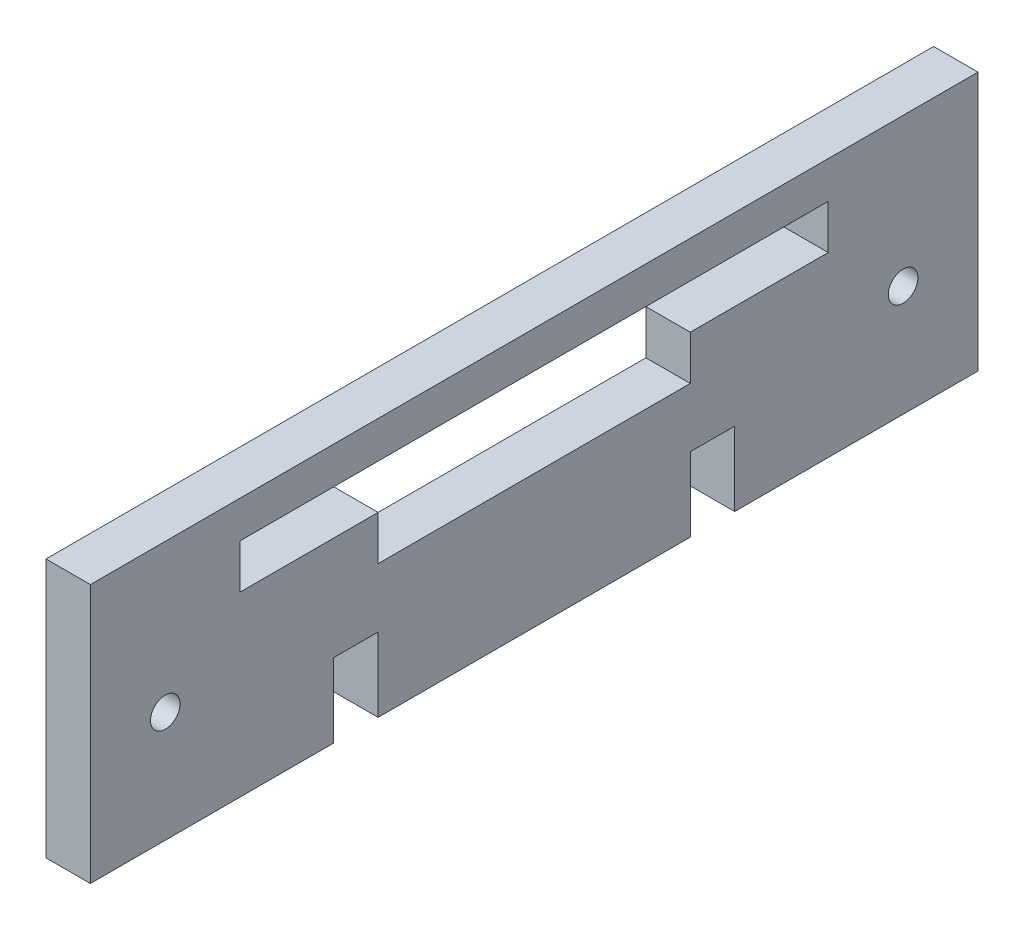
ISO-10303-21;
HEADER;
FILE_DESCRIPTION(('STEP AP214'),'2;1');
FILE_NAME('part.step','',(''),(''),'','','');
FILE_SCHEMA(('AUTOMOTIVE_DESIGN { 1 0 10303 214 1 1 1 1 }'));
ENDSEC;
DATA;
#1=APPLICATION_CONTEXT('core data for automotive mechanical design processes');
#2=APPLICATION_PROTOCOL_DEFINITION('international standard','automotive_design',2000,#1);
#3=PRODUCT_CONTEXT('',#1,'mechanical');
#4=PRODUCT('Part','Part','',(#3));
#5=PRODUCT_RELATED_PRODUCT_CATEGORY('part','',(#4));
#6=PRODUCT_DEFINITION_FORMATION('','',#4);
#7=PRODUCT_DEFINITION_CONTEXT('part definition',#1,'design');
#8=PRODUCT_DEFINITION('design','',#6,#7);
#9=PRODUCT_DEFINITION_SHAPE('','',#8);
#10=(LENGTH_UNIT() NAMED_UNIT(*) SI_UNIT(.MILLI.,.METRE.));
#11=(NAMED_UNIT(*) PLANE_ANGLE_UNIT() SI_UNIT($,.RADIAN.));
#12=(NAMED_UNIT(*) SI_UNIT($,.STERADIAN.) SOLID_ANGLE_UNIT());
#13=UNCERTAINTY_MEASURE_WITH_UNIT(LENGTH_MEASURE(1.E-05),#10,'distance_accuracy_value','');
#14=(GEOMETRIC_REPRESENTATION_CONTEXT(3) GLOBAL_UNCERTAINTY_ASSIGNED_CONTEXT((#13)) GLOBAL_UNIT_ASSIGNED_CONTEXT((#10,
#11,#12)) REPRESENTATION_CONTEXT('',''));
#15=CARTESIAN_POINT('',(0.,0.,0.));
#16=DIRECTION('',(0.,0.,1.));
#17=DIRECTION('',(1.,0.,0.));
#18=AXIS2_PLACEMENT_3D('',#15,#16,#17);
#19=CARTESIAN_POINT('',(6.,9.,39.75));
#20=DIRECTION('',(0.,-1.,0.));
#21=DIRECTION('',(0.,0.,-1.));
#22=AXIS2_PLACEMENT_3D('',#19,#20,#21);
#23=PLANE('',#22);
#24=DIRECTION('',(1.,0.,0.));
#25=VECTOR('',#24,1.);
#26=CARTESIAN_POINT('',(0.,9.,-21.1));
#27=LINE('',#26,#25);
#28=CARTESIAN_POINT('',(0.,9.,-21.1));
#29=VERTEX_POINT('',#28);
#30=CARTESIAN_POINT('',(6.,9.,-21.1));
#31=VERTEX_POINT('',#30);
#32=EDGE_CURVE('E55',#29,#31,#27,.T.);
#33=ORIENTED_EDGE('',*,*,#32,.T.);
#34=DIRECTION('',(0.,0.,1.));
#35=VECTOR('',#34,1.);
#36=CARTESIAN_POINT('',(6.,9.,39.75));
#37=LINE('',#36,#35);
#38=CARTESIAN_POINT('',(6.,9.,-39.75));
#39=VERTEX_POINT('',#38);
#40=EDGE_CURVE('E273',#39,#31,#37,.T.);
#41=ORIENTED_EDGE('',*,*,#40,.F.);
#42=DIRECTION('',(-1.,0.,0.));
#43=VECTOR('',#42,1.);
#44=CARTESIAN_POINT('',(6.,9.,-39.75));
#45=LINE('',#44,#43);
#46=CARTESIAN_POINT('',(0.,9.,-39.75));
#47=VERTEX_POINT('',#46);
#48=EDGE_CURVE('E47',#39,#47,#45,.T.);
#49=ORIENTED_EDGE('',*,*,#48,.T.);
#50=DIRECTION('',(0.,0.,1.));
#51=VECTOR('',#50,1.);
#52=CARTESIAN_POINT('',(0.,9.,39.75));
#53=LINE('',#52,#51);
#54=EDGE_CURVE('E382',#47,#29,#53,.T.);
#55=ORIENTED_EDGE('',*,*,#54,.T.);
#56=EDGE_LOOP('',(#33,#41,#49,#55));
#57=FACE_BOUND('',#56,.T.);
#58=ADVANCED_FACE('F38',(#57),#23,.F.);
#59=CARTESIAN_POINT('',(6.,-15.,60.));
#60=DIRECTION('',(0.,1.,0.));
#61=DIRECTION('',(0.,0.,1.));
#62=AXIS2_PLACEMENT_3D('',#59,#60,#61);
#63=PLANE('',#62);
#64=DIRECTION('',(0.,0.,-1.));
#65=VECTOR('',#64,1.);
#66=CARTESIAN_POINT('',(0.,-15.,60.));
#67=LINE('',#66,#65);
#68=CARTESIAN_POINT('',(0.,-15.,60.));
#69=VERTEX_POINT('',#68);
#70=CARTESIAN_POINT('',(0.,-15.,27.1));
#71=VERTEX_POINT('',#70);
#72=EDGE_CURVE('E265',#69,#71,#67,.T.);
#73=ORIENTED_EDGE('',*,*,#72,.T.);
#74=DIRECTION('',(1.,0.,0.));
#75=VECTOR('',#74,1.);
#76=CARTESIAN_POINT('',(0.,-15.,27.1));
#77=LINE('',#76,#75);
#78=CARTESIAN_POINT('',(6.,-15.,27.1));
#79=VERTEX_POINT('',#78);
#80=EDGE_CURVE('E345',#71,#79,#77,.T.);
#81=ORIENTED_EDGE('',*,*,#80,.T.);
#82=DIRECTION('',(0.,0.,-1.));
#83=VECTOR('',#82,1.);
#84=CARTESIAN_POINT('',(6.,-15.,60.));
#85=LINE('',#84,#83);
#86=CARTESIAN_POINT('',(6.,-15.,60.));
#87=VERTEX_POINT('',#86);
#88=EDGE_CURVE('E235',#87,#79,#85,.T.);
#89=ORIENTED_EDGE('',*,*,#88,.F.);
#90=DIRECTION('',(-1.,0.,0.));
#91=VECTOR('',#90,1.);
#92=CARTESIAN_POINT('',(6.,-15.,60.));
#93=LINE('',#92,#91);
#94=EDGE_CURVE('E370',#87,#69,#93,.T.);
#95=ORIENTED_EDGE('',*,*,#94,.T.);
#96=EDGE_LOOP('',(#73,#81,#89,#95));
#97=FACE_BOUND('',#96,.T.);
#98=ADVANCED_FACE('F420',(#97),#63,.F.);
#99=CARTESIAN_POINT('',(6.,-15.,21.1));
#100=VERTEX_POINT('',#99);
#101=CARTESIAN_POINT('',(6.,-15.,-21.1));
#102=VERTEX_POINT('',#101);
#103=EDGE_CURVE('E242',#100,#102,#85,.T.);
#104=ORIENTED_EDGE('',*,*,#103,.F.);
#105=DIRECTION('',(1.,0.,0.));
#106=VECTOR('',#105,1.);
#107=CARTESIAN_POINT('',(0.,-15.,21.1));
#108=LINE('',#107,#106);
#109=CARTESIAN_POINT('',(0.,-15.,21.1));
#110=VERTEX_POINT('',#109);
#111=EDGE_CURVE('E348',#110,#100,#108,.T.);
#112=ORIENTED_EDGE('',*,*,#111,.F.);
#113=CARTESIAN_POINT('',(0.,-15.,-21.1));
#114=VERTEX_POINT('',#113);
#115=EDGE_CURVE('E393',#110,#114,#67,.T.);
#116=ORIENTED_EDGE('',*,*,#115,.T.);
#117=DIRECTION('',(1.,0.,0.));
#118=VECTOR('',#117,1.);
#119=CARTESIAN_POINT('',(0.,-15.,-21.1));
#120=LINE('',#119,#118);
#121=EDGE_CURVE('E315',#114,#102,#120,.T.);
#122=ORIENTED_EDGE('',*,*,#121,.T.);
#123=EDGE_LOOP('',(#104,#112,#116,#122));
#124=FACE_BOUND('',#123,.T.);
#125=ADVANCED_FACE('F426',(#124),#63,.F.);
#126=CARTESIAN_POINT('',(6.,15.,-60.));
#127=DIRECTION('',(0.,0.,1.));
#128=DIRECTION('',(1.,0.,0.));
#129=AXIS2_PLACEMENT_3D('',#126,#127,#128);
#130=PLANE('',#129);
#131=DIRECTION('',(0.,1.,0.));
#132=VECTOR('',#131,1.);
#133=CARTESIAN_POINT('',(0.,15.,-60.));
#134=LINE('',#133,#132);
#135=CARTESIAN_POINT('',(0.,-15.,-60.));
#136=VERTEX_POINT('',#135);
#137=CARTESIAN_POINT('',(0.,20.,-60.));
#138=VERTEX_POINT('',#137);
#139=EDGE_CURVE('E247',#136,#138,#134,.T.);
#140=ORIENTED_EDGE('',*,*,#139,.T.);
#141=DIRECTION('',(-1.,0.,0.));
#142=VECTOR('',#141,1.);
#143=CARTESIAN_POINT('',(0.,20.,-60.));
#144=LINE('',#143,#142);
#145=CARTESIAN_POINT('',(6.,20.,-60.));
#146=VERTEX_POINT('',#145);
#147=EDGE_CURVE('E298',#146,#138,#144,.T.);
#148=ORIENTED_EDGE('',*,*,#147,.F.);
#149=DIRECTION('',(0.,1.,0.));
#150=VECTOR('',#149,1.);
#151=CARTESIAN_POINT('',(6.,15.,-60.));
#152=LINE('',#151,#150);
#153=CARTESIAN_POINT('',(6.,-15.,-60.));
#154=VERTEX_POINT('',#153);
#155=EDGE_CURVE('E260',#154,#146,#152,.T.);
#156=ORIENTED_EDGE('',*,*,#155,.F.);
#157=DIRECTION('',(-1.,0.,0.));
#158=VECTOR('',#157,1.);
#159=CARTESIAN_POINT('',(6.,-15.,-60.));
#160=LINE('',#159,#158);
#161=EDGE_CURVE('E241',#154,#136,#160,.T.);
#162=ORIENTED_EDGE('',*,*,#161,.T.);
#163=EDGE_LOOP('',(#140,#148,#156,#162));
#164=FACE_BOUND('',#163,.T.);
#165=ADVANCED_FACE('F40',(#164),#130,.F.);
#166=CARTESIAN_POINT('',(6.,15.,-39.75));
#167=DIRECTION('',(0.,0.,-1.));
#168=DIRECTION('',(-1.,0.,0.));
#169=AXIS2_PLACEMENT_3D('',#166,#167,#168);
#170=PLANE('',#169);
#171=DIRECTION('',(0.,-1.,0.));
#172=VECTOR('',#171,1.);
#173=CARTESIAN_POINT('',(0.,15.,-39.75));
#174=LINE('',#173,#172);
#175=CARTESIAN_POINT('',(0.,15.,-39.75));
#176=VERTEX_POINT('',#175);
#177=EDGE_CURVE('E359',#176,#47,#174,.T.);
#178=ORIENTED_EDGE('',*,*,#177,.T.);
#179=ORIENTED_EDGE('',*,*,#48,.F.);
#180=DIRECTION('',(0.,-1.,0.));
#181=VECTOR('',#180,1.);
#182=CARTESIAN_POINT('',(6.,15.,-39.75));
#183=LINE('',#182,#181);
#184=CARTESIAN_POINT('',(6.,15.,-39.75));
#185=VERTEX_POINT('',#184);
#186=EDGE_CURVE('E264',#185,#39,#183,.T.);
#187=ORIENTED_EDGE('',*,*,#186,.F.);
#188=DIRECTION('',(-1.,0.,0.));
#189=VECTOR('',#188,1.);
#190=CARTESIAN_POINT('',(6.,15.,-39.75));
#191=LINE('',#190,#189);
#192=EDGE_CURVE('E12',#185,#176,#191,.T.);
#193=ORIENTED_EDGE('',*,*,#192,.T.);
#194=EDGE_LOOP('',(#178,#179,#187,#193));
#195=FACE_BOUND('',#194,.T.);
#196=ADVANCED_FACE('F433',(#195),#170,.F.);
#197=CARTESIAN_POINT('',(6.,9.,21.1));
#198=VERTEX_POINT('',#197);
#199=CARTESIAN_POINT('',(6.,9.,39.75));
#200=VERTEX_POINT('',#199);
#201=EDGE_CURVE('E272',#198,#200,#37,.T.);
#202=ORIENTED_EDGE('',*,*,#201,.F.);
#203=DIRECTION('',(1.,0.,0.));
#204=VECTOR('',#203,1.);
#205=CARTESIAN_POINT('',(0.,9.,21.1));
#206=LINE('',#205,#204);
#207=CARTESIAN_POINT('',(0.,9.,21.1));
#208=VERTEX_POINT('',#207);
#209=EDGE_CURVE('E443',#208,#198,#206,.T.);
#210=ORIENTED_EDGE('',*,*,#209,.F.);
#211=CARTESIAN_POINT('',(0.,9.,39.75));
#212=VERTEX_POINT('',#211);
#213=EDGE_CURVE('E385',#208,#212,#53,.T.);
#214=ORIENTED_EDGE('',*,*,#213,.T.);
#215=DIRECTION('',(-1.,0.,0.));
#216=VECTOR('',#215,1.);
#217=CARTESIAN_POINT('',(6.,9.,39.75));
#218=LINE('',#217,#216);
#219=EDGE_CURVE('E369',#200,#212,#218,.T.);
#220=ORIENTED_EDGE('',*,*,#219,.F.);
#221=EDGE_LOOP('',(#202,#210,#214,#220));
#222=FACE_BOUND('',#221,.T.);
#223=ADVANCED_FACE('F422',(#222),#23,.F.);
#224=CARTESIAN_POINT('',(6.,15.,39.75));
#225=DIRECTION('',(0.,0.,1.));
#226=DIRECTION('',(1.,0.,0.));
#227=AXIS2_PLACEMENT_3D('',#224,#225,#226);
#228=PLANE('',#227);
#229=DIRECTION('',(0.,1.,0.));
#230=VECTOR('',#229,1.);
#231=CARTESIAN_POINT('',(0.,15.,39.75));
#232=LINE('',#231,#230);
#233=CARTESIAN_POINT('',(0.,15.,39.75));
#234=VERTEX_POINT('',#233);
#235=EDGE_CURVE('E358',#212,#234,#232,.T.);
#236=ORIENTED_EDGE('',*,*,#235,.T.);
#237=DIRECTION('',(-1.,0.,0.));
#238=VECTOR('',#237,1.);
#239=CARTESIAN_POINT('',(6.,15.,39.75));
#240=LINE('',#239,#238);
#241=CARTESIAN_POINT('',(6.,15.,39.75));
#242=VERTEX_POINT('',#241);
#243=EDGE_CURVE('E366',#242,#234,#240,.T.);
#244=ORIENTED_EDGE('',*,*,#243,.F.);
#245=DIRECTION('',(0.,1.,0.));
#246=VECTOR('',#245,1.);
#247=CARTESIAN_POINT('',(6.,15.,39.75));
#248=LINE('',#247,#246);
#249=EDGE_CURVE('E449',#200,#242,#248,.T.);
#250=ORIENTED_EDGE('',*,*,#249,.F.);
#251=ORIENTED_EDGE('',*,*,#219,.T.);
#252=EDGE_LOOP('',(#236,#244,#250,#251));
#253=FACE_BOUND('',#252,.T.);
#254=ADVANCED_FACE('F432',(#253),#228,.F.);
#255=CARTESIAN_POINT('',(6.,15.,60.));
#256=DIRECTION('',(0.,0.,-1.));
#257=DIRECTION('',(0.,1.,0.));
#258=AXIS2_PLACEMENT_3D('',#255,#256,#257);
#259=PLANE('',#258);
#260=DIRECTION('',(0.,-1.,0.));
#261=VECTOR('',#260,1.);
#262=CARTESIAN_POINT('',(0.,15.,60.));
#263=LINE('',#262,#261);
#264=CARTESIAN_POINT('',(0.,20.,60.));
#265=VERTEX_POINT('',#264);
#266=EDGE_CURVE('E387',#265,#69,#263,.T.);
#267=ORIENTED_EDGE('',*,*,#266,.T.);
#268=ORIENTED_EDGE('',*,*,#94,.F.);
#269=DIRECTION('',(0.,-1.,0.));
#270=VECTOR('',#269,1.);
#271=CARTESIAN_POINT('',(6.,15.,60.));
#272=LINE('',#271,#270);
#273=CARTESIAN_POINT('',(6.,20.,60.));
#274=VERTEX_POINT('',#273);
#275=EDGE_CURVE('E244',#274,#87,#272,.T.);
#276=ORIENTED_EDGE('',*,*,#275,.F.);
#277=DIRECTION('',(1.,0.,0.));
#278=VECTOR('',#277,1.);
#279=CARTESIAN_POINT('',(0.,20.,60.));
#280=LINE('',#279,#278);
#281=EDGE_CURVE('E309',#265,#274,#280,.T.);
#282=ORIENTED_EDGE('',*,*,#281,.F.);
#283=EDGE_LOOP('',(#267,#268,#276,#282));
#284=FACE_BOUND('',#283,.T.);
#285=ADVANCED_FACE('F439',(#284),#259,.F.);
#286=CARTESIAN_POINT('',(6.,-15.,-27.1));
#287=VERTEX_POINT('',#286);
#288=EDGE_CURVE('E243',#287,#154,#85,.T.);
#289=ORIENTED_EDGE('',*,*,#288,.F.);
#290=DIRECTION('',(1.,0.,0.));
#291=VECTOR('',#290,1.);
#292=CARTESIAN_POINT('',(0.,-15.,-27.1));
#293=LINE('',#292,#291);
#294=CARTESIAN_POINT('',(0.,-15.,-27.1));
#295=VERTEX_POINT('',#294);
#296=EDGE_CURVE('E318',#295,#287,#293,.T.);
#297=ORIENTED_EDGE('',*,*,#296,.F.);
#298=EDGE_CURVE('E391',#295,#136,#67,.T.);
#299=ORIENTED_EDGE('',*,*,#298,.T.);
#300=ORIENTED_EDGE('',*,*,#161,.F.);
#301=EDGE_LOOP('',(#289,#297,#299,#300));
#302=FACE_BOUND('',#301,.T.);
#303=ADVANCED_FACE('F429',(#302),#63,.F.);
#304=CARTESIAN_POINT('',(6.,0.,0.));
#305=DIRECTION('',(1.,0.,0.));
#306=DIRECTION('',(0.,0.,-1.));
#307=AXIS2_PLACEMENT_3D('',#304,#305,#306);
#308=PLANE('',#307);
#309=DIRECTION('',(0.,-1.,0.));
#310=VECTOR('',#309,1.);
#311=CARTESIAN_POINT('',(6.,9.,21.1));
#312=LINE('',#311,#310);
#313=CARTESIAN_POINT('',(6.,3.,21.1));
#314=VERTEX_POINT('',#313);
#315=EDGE_CURVE('E196',#198,#314,#312,.T.);
#316=ORIENTED_EDGE('',*,*,#315,.F.);
#317=ORIENTED_EDGE('',*,*,#201,.T.);
#318=ORIENTED_EDGE('',*,*,#249,.T.);
#319=DIRECTION('',(0.,0.,-1.));
#320=VECTOR('',#319,1.);
#321=CARTESIAN_POINT('',(6.,15.,60.));
#322=LINE('',#321,#320);
#323=EDGE_CURVE('E280',#242,#185,#322,.T.);
#324=ORIENTED_EDGE('',*,*,#323,.T.);
#325=ORIENTED_EDGE('',*,*,#186,.T.);
#326=ORIENTED_EDGE('',*,*,#40,.T.);
#327=DIRECTION('',(0.,-1.,0.));
#328=VECTOR('',#327,1.);
#329=CARTESIAN_POINT('',(6.,9.,-21.1));
#330=LINE('',#329,#328);
#331=CARTESIAN_POINT('',(6.,3.,-21.1));
#332=VERTEX_POINT('',#331);
#333=EDGE_CURVE('E200',#31,#332,#330,.T.);
#334=ORIENTED_EDGE('',*,*,#333,.T.);
#335=DIRECTION('',(0.,0.,-1.));
#336=VECTOR('',#335,1.);
#337=CARTESIAN_POINT('',(6.,3.,21.1));
#338=LINE('',#337,#336);
#339=EDGE_CURVE('E191',#314,#332,#338,.T.);
#340=ORIENTED_EDGE('',*,*,#339,.F.);
#341=EDGE_LOOP('',(#316,#317,#318,#324,#325,#326,#334,#340));
#342=FACE_BOUND('',#341,.T.);
#343=DIRECTION('',(0.,-1.,0.));
#344=VECTOR('',#343,1.);
#345=CARTESIAN_POINT('',(6.,-15.,27.1));
#346=LINE('',#345,#344);
#347=CARTESIAN_POINT('',(6.,-5.,27.1));
#348=VERTEX_POINT('',#347);
#349=EDGE_CURVE('E216',#348,#79,#346,.T.);
#350=ORIENTED_EDGE('',*,*,#349,.F.);
#351=DIRECTION('',(0.,0.,1.));
#352=VECTOR('',#351,1.);
#353=CARTESIAN_POINT('',(6.,-5.,27.1));
#354=LINE('',#353,#352);
#355=CARTESIAN_POINT('',(6.,-5.,21.1));
#356=VERTEX_POINT('',#355);
#357=EDGE_CURVE('E227',#356,#348,#354,.T.);
#358=ORIENTED_EDGE('',*,*,#357,.F.);
#359=DIRECTION('',(0.,1.,0.));
#360=VECTOR('',#359,1.);
#361=CARTESIAN_POINT('',(6.,-15.,21.1));
#362=LINE('',#361,#360);
#363=EDGE_CURVE('E221',#100,#356,#362,.T.);
#364=ORIENTED_EDGE('',*,*,#363,.F.);
#365=ORIENTED_EDGE('',*,*,#103,.T.);
#366=DIRECTION('',(0.,-1.,0.));
#367=VECTOR('',#366,1.);
#368=CARTESIAN_POINT('',(6.,-15.,-21.1));
#369=LINE('',#368,#367);
#370=CARTESIAN_POINT('',(6.,-5.,-21.1));
#371=VERTEX_POINT('',#370);
#372=EDGE_CURVE('E333',#371,#102,#369,.T.);
#373=ORIENTED_EDGE('',*,*,#372,.F.);
#374=DIRECTION('',(0.,0.,1.));
#375=VECTOR('',#374,1.);
#376=CARTESIAN_POINT('',(6.,-5.,-21.1));
#377=LINE('',#376,#375);
#378=CARTESIAN_POINT('',(6.,-5.,-27.1));
#379=VERTEX_POINT('',#378);
#380=EDGE_CURVE('E324',#379,#371,#377,.T.);
#381=ORIENTED_EDGE('',*,*,#380,.F.);
#382=DIRECTION('',(0.,1.,0.));
#383=VECTOR('',#382,1.);
#384=CARTESIAN_POINT('',(6.,-15.,-27.1));
#385=LINE('',#384,#383);
#386=EDGE_CURVE('E329',#287,#379,#385,.T.);
#387=ORIENTED_EDGE('',*,*,#386,.F.);
#388=ORIENTED_EDGE('',*,*,#288,.T.);
#389=ORIENTED_EDGE('',*,*,#155,.T.);
#390=DIRECTION('',(0.,0.,-1.));
#391=VECTOR('',#390,1.);
#392=CARTESIAN_POINT('',(6.,20.,60.));
#393=LINE('',#392,#391);
#394=EDGE_CURVE('E302',#274,#146,#393,.T.);
#395=ORIENTED_EDGE('',*,*,#394,.F.);
#396=ORIENTED_EDGE('',*,*,#275,.T.);
#397=ORIENTED_EDGE('',*,*,#88,.T.);
#398=EDGE_LOOP('',(#350,#358,#364,#365,#373,#381,#387,#388,#389,#395,#396,#397));
#399=FACE_BOUND('',#398,.T.);
#400=CARTESIAN_POINT('',(6.,0.,49.875));
#401=DIRECTION('',(1.,0.,0.));
#402=DIRECTION('',(0.,0.,-1.));
#403=AXIS2_PLACEMENT_3D('',#400,#401,#402);
#404=CIRCLE('',#403,2.);
#405=CARTESIAN_POINT('',(6.,0.,47.875));
#406=VERTEX_POINT('',#405);
#407=EDGE_CURVE('E288',#406,#406,#404,.T.);
#408=ORIENTED_EDGE('',*,*,#407,.F.);
#409=EDGE_LOOP('',(#408));
#410=FACE_BOUND('',#409,.T.);
#411=CARTESIAN_POINT('',(6.,0.,-49.875));
#412=DIRECTION('',(1.,0.,0.));
#413=DIRECTION('',(0.,0.,1.));
#414=AXIS2_PLACEMENT_3D('',#411,#412,#413);
#415=CIRCLE('',#414,2.);
#416=CARTESIAN_POINT('',(6.,0.,-47.875));
#417=VERTEX_POINT('',#416);
#418=EDGE_CURVE('E266',#417,#417,#415,.T.);
#419=ORIENTED_EDGE('',*,*,#418,.F.);
#420=EDGE_LOOP('',(#419));
#421=FACE_BOUND('',#420,.T.);
#422=ADVANCED_FACE('F464',(#342,#399,#410,#421),#308,.T.);
#423=CARTESIAN_POINT('',(0.,0.,0.));
#424=DIRECTION('',(1.,0.,0.));
#425=DIRECTION('',(0.,0.,-1.));
#426=AXIS2_PLACEMENT_3D('',#423,#424,#425);
#427=PLANE('',#426);
#428=DIRECTION('',(0.,0.,1.));
#429=VECTOR('',#428,1.);
#430=CARTESIAN_POINT('',(0.,-5.,27.1));
#431=LINE('',#430,#429);
#432=CARTESIAN_POINT('',(0.,-5.,21.1));
#433=VERTEX_POINT('',#432);
#434=CARTESIAN_POINT('',(0.,-5.,27.1));
#435=VERTEX_POINT('',#434);
#436=EDGE_CURVE('E63',#433,#435,#431,.T.);
#437=ORIENTED_EDGE('',*,*,#436,.T.);
#438=DIRECTION('',(0.,-1.,0.));
#439=VECTOR('',#438,1.);
#440=CARTESIAN_POINT('',(0.,-15.,27.1));
#441=LINE('',#440,#439);
#442=EDGE_CURVE('E649',#435,#71,#441,.T.);
#443=ORIENTED_EDGE('',*,*,#442,.T.);
#444=ORIENTED_EDGE('',*,*,#72,.F.);
#445=ORIENTED_EDGE('',*,*,#266,.F.);
#446=DIRECTION('',(0.,0.,1.));
#447=VECTOR('',#446,1.);
#448=CARTESIAN_POINT('',(0.,20.,60.));
#449=LINE('',#448,#447);
#450=EDGE_CURVE('E285',#138,#265,#449,.T.);
#451=ORIENTED_EDGE('',*,*,#450,.F.);
#452=ORIENTED_EDGE('',*,*,#139,.F.);
#453=ORIENTED_EDGE('',*,*,#298,.F.);
#454=DIRECTION('',(0.,1.,0.));
#455=VECTOR('',#454,1.);
#456=CARTESIAN_POINT('',(0.,-15.,-27.1));
#457=LINE('',#456,#455);
#458=CARTESIAN_POINT('',(0.,-5.,-27.1));
#459=VERTEX_POINT('',#458);
#460=EDGE_CURVE('E340',#295,#459,#457,.T.);
#461=ORIENTED_EDGE('',*,*,#460,.T.);
#462=DIRECTION('',(0.,0.,1.));
#463=VECTOR('',#462,1.);
#464=CARTESIAN_POINT('',(0.,-5.,-21.1));
#465=LINE('',#464,#463);
#466=CARTESIAN_POINT('',(0.,-5.,-21.1));
#467=VERTEX_POINT('',#466);
#468=EDGE_CURVE('E319',#459,#467,#465,.T.);
#469=ORIENTED_EDGE('',*,*,#468,.T.);
#470=DIRECTION('',(0.,-1.,0.));
#471=VECTOR('',#470,1.);
#472=CARTESIAN_POINT('',(0.,-15.,-21.1));
#473=LINE('',#472,#471);
#474=EDGE_CURVE('E328',#467,#114,#473,.T.);
#475=ORIENTED_EDGE('',*,*,#474,.T.);
#476=ORIENTED_EDGE('',*,*,#115,.F.);
#477=DIRECTION('',(0.,1.,0.));
#478=VECTOR('',#477,1.);
#479=CARTESIAN_POINT('',(0.,-15.,21.1));
#480=LINE('',#479,#478);
#481=EDGE_CURVE('E651',#110,#433,#480,.T.);
#482=ORIENTED_EDGE('',*,*,#481,.T.);
#483=EDGE_LOOP('',(#437,#443,#444,#445,#451,#452,#453,#461,#469,#475,#476,#482));
#484=FACE_BOUND('',#483,.T.);
#485=CARTESIAN_POINT('',(0.,0.,49.875));
#486=DIRECTION('',(1.,0.,0.));
#487=DIRECTION('',(0.,0.,-1.));
#488=AXIS2_PLACEMENT_3D('',#485,#486,#487);
#489=CIRCLE('',#488,2.);
#490=CARTESIAN_POINT('',(0.,0.,47.875));
#491=VERTEX_POINT('',#490);
#492=EDGE_CURVE('E42',#491,#491,#489,.T.);
#493=ORIENTED_EDGE('',*,*,#492,.T.);
#494=EDGE_LOOP('',(#493));
#495=FACE_BOUND('',#494,.T.);
#496=CARTESIAN_POINT('',(0.,0.,-49.875));
#497=DIRECTION('',(1.,0.,0.));
#498=DIRECTION('',(0.,0.,-1.));
#499=AXIS2_PLACEMENT_3D('',#496,#497,#498);
#500=CIRCLE('',#499,2.);
#501=CARTESIAN_POINT('',(0.,0.,-51.875));
#502=VERTEX_POINT('',#501);
#503=EDGE_CURVE('E292',#502,#502,#500,.T.);
#504=ORIENTED_EDGE('',*,*,#503,.T.);
#505=EDGE_LOOP('',(#504));
#506=FACE_BOUND('',#505,.T.);
#507=ORIENTED_EDGE('',*,*,#213,.F.);
#508=DIRECTION('',(0.,-1.,0.));
#509=VECTOR('',#508,1.);
#510=CARTESIAN_POINT('',(0.,9.,21.1));
#511=LINE('',#510,#509);
#512=CARTESIAN_POINT('',(0.,3.,21.1));
#513=VERTEX_POINT('',#512);
#514=EDGE_CURVE('E183',#208,#513,#511,.T.);
#515=ORIENTED_EDGE('',*,*,#514,.T.);
#516=DIRECTION('',(0.,0.,-1.));
#517=VECTOR('',#516,1.);
#518=CARTESIAN_POINT('',(0.,3.,21.1));
#519=LINE('',#518,#517);
#520=CARTESIAN_POINT('',(0.,3.,-21.1));
#521=VERTEX_POINT('',#520);
#522=EDGE_CURVE('E184',#513,#521,#519,.T.);
#523=ORIENTED_EDGE('',*,*,#522,.T.);
#524=DIRECTION('',(0.,-1.,0.));
#525=VECTOR('',#524,1.);
#526=CARTESIAN_POINT('',(0.,9.,-21.1));
#527=LINE('',#526,#525);
#528=EDGE_CURVE('E174',#29,#521,#527,.T.);
#529=ORIENTED_EDGE('',*,*,#528,.F.);
#530=ORIENTED_EDGE('',*,*,#54,.F.);
#531=ORIENTED_EDGE('',*,*,#177,.F.);
#532=DIRECTION('',(0.,0.,1.));
#533=VECTOR('',#532,1.);
#534=CARTESIAN_POINT('',(0.,15.,60.));
#535=LINE('',#534,#533);
#536=EDGE_CURVE('E286',#176,#234,#535,.T.);
#537=ORIENTED_EDGE('',*,*,#536,.T.);
#538=ORIENTED_EDGE('',*,*,#235,.F.);
#539=EDGE_LOOP('',(#507,#515,#523,#529,#530,#531,#537,#538));
#540=FACE_BOUND('',#539,.T.);
#541=ADVANCED_FACE('F195',(#484,#495,#506,#540),#427,.F.);
#542=CARTESIAN_POINT('',(-4.,0.,-49.875));
#543=DIRECTION('',(1.,0.,0.));
#544=DIRECTION('',(0.,0.,-1.));
#545=AXIS2_PLACEMENT_3D('',#542,#543,#544);
#546=CYLINDRICAL_SURFACE('',#545,2.);
#547=ORIENTED_EDGE('',*,*,#418,.T.);
#548=EDGE_LOOP('',(#547));
#549=FACE_BOUND('',#548,.T.);
#550=ORIENTED_EDGE('',*,*,#503,.F.);
#551=EDGE_LOOP('',(#550));
#552=FACE_BOUND('',#551,.T.);
#553=ADVANCED_FACE('F410',(#549,#552),#546,.F.);
#554=CARTESIAN_POINT('',(-4.,0.,49.875));
#555=DIRECTION('',(1.,0.,0.));
#556=DIRECTION('',(0.,0.,-1.));
#557=AXIS2_PLACEMENT_3D('',#554,#555,#556);
#558=CYLINDRICAL_SURFACE('',#557,2.);
#559=ORIENTED_EDGE('',*,*,#407,.T.);
#560=EDGE_LOOP('',(#559));
#561=FACE_BOUND('',#560,.T.);
#562=ORIENTED_EDGE('',*,*,#492,.F.);
#563=EDGE_LOOP('',(#562));
#564=FACE_BOUND('',#563,.T.);
#565=ADVANCED_FACE('F408',(#561,#564),#558,.F.);
#566=CARTESIAN_POINT('',(0.,15.,0.));
#567=DIRECTION('',(0.,-1.,0.));
#568=DIRECTION('',(0.,0.,-1.));
#569=AXIS2_PLACEMENT_3D('',#566,#567,#568);
#570=PLANE('',#569);
#571=ORIENTED_EDGE('',*,*,#192,.F.);
#572=ORIENTED_EDGE('',*,*,#323,.F.);
#573=ORIENTED_EDGE('',*,*,#243,.T.);
#574=ORIENTED_EDGE('',*,*,#536,.F.);
#575=EDGE_LOOP('',(#571,#572,#573,#574));
#576=FACE_BOUND('',#575,.T.);
#577=ADVANCED_FACE('F363',(#576),#570,.T.);
#578=CARTESIAN_POINT('',(0.,20.,0.));
#579=DIRECTION('',(0.,-1.,0.));
#580=DIRECTION('',(0.,0.,-1.));
#581=AXIS2_PLACEMENT_3D('',#578,#579,#580);
#582=PLANE('',#581);
#583=ORIENTED_EDGE('',*,*,#450,.T.);
#584=ORIENTED_EDGE('',*,*,#281,.T.);
#585=ORIENTED_EDGE('',*,*,#394,.T.);
#586=ORIENTED_EDGE('',*,*,#147,.T.);
#587=EDGE_LOOP('',(#583,#584,#585,#586));
#588=FACE_BOUND('',#587,.T.);
#589=ADVANCED_FACE('F416',(#588),#582,.F.);
#590=CARTESIAN_POINT('',(0.,-15.,-21.1));
#591=DIRECTION('',(0.,0.,1.));
#592=DIRECTION('',(1.,0.,0.));
#593=AXIS2_PLACEMENT_3D('',#590,#591,#592);
#594=PLANE('',#593);
#595=ORIENTED_EDGE('',*,*,#372,.T.);
#596=ORIENTED_EDGE('',*,*,#121,.F.);
#597=ORIENTED_EDGE('',*,*,#474,.F.);
#598=DIRECTION('',(1.,0.,0.));
#599=VECTOR('',#598,1.);
#600=CARTESIAN_POINT('',(0.,-5.,-21.1));
#601=LINE('',#600,#599);
#602=EDGE_CURVE('E222',#467,#371,#601,.T.);
#603=ORIENTED_EDGE('',*,*,#602,.T.);
#604=EDGE_LOOP('',(#595,#596,#597,#603));
#605=FACE_BOUND('',#604,.T.);
#606=ADVANCED_FACE('F474',(#605),#594,.F.);
#607=CARTESIAN_POINT('',(0.,-5.,-21.1));
#608=DIRECTION('',(0.,1.,0.));
#609=DIRECTION('',(0.,0.,1.));
#610=AXIS2_PLACEMENT_3D('',#607,#608,#609);
#611=PLANE('',#610);
#612=ORIENTED_EDGE('',*,*,#380,.T.);
#613=ORIENTED_EDGE('',*,*,#602,.F.);
#614=ORIENTED_EDGE('',*,*,#468,.F.);
#615=DIRECTION('',(1.,0.,0.));
#616=VECTOR('',#615,1.);
#617=CARTESIAN_POINT('',(0.,-5.,-27.1));
#618=LINE('',#617,#616);
#619=EDGE_CURVE('E321',#459,#379,#618,.T.);
#620=ORIENTED_EDGE('',*,*,#619,.T.);
#621=EDGE_LOOP('',(#612,#613,#614,#620));
#622=FACE_BOUND('',#621,.T.);
#623=ADVANCED_FACE('F478',(#622),#611,.F.);
#624=CARTESIAN_POINT('',(0.,-15.,-27.1));
#625=DIRECTION('',(0.,0.,-1.));
#626=DIRECTION('',(-1.,0.,0.));
#627=AXIS2_PLACEMENT_3D('',#624,#625,#626);
#628=PLANE('',#627);
#629=ORIENTED_EDGE('',*,*,#386,.T.);
#630=ORIENTED_EDGE('',*,*,#619,.F.);
#631=ORIENTED_EDGE('',*,*,#460,.F.);
#632=ORIENTED_EDGE('',*,*,#296,.T.);
#633=EDGE_LOOP('',(#629,#630,#631,#632));
#634=FACE_BOUND('',#633,.T.);
#635=ADVANCED_FACE('F480',(#634),#628,.F.);
#636=CARTESIAN_POINT('',(0.,-15.,27.1));
#637=DIRECTION('',(0.,0.,1.));
#638=DIRECTION('',(1.,0.,0.));
#639=AXIS2_PLACEMENT_3D('',#636,#637,#638);
#640=PLANE('',#639);
#641=ORIENTED_EDGE('',*,*,#349,.T.);
#642=ORIENTED_EDGE('',*,*,#80,.F.);
#643=ORIENTED_EDGE('',*,*,#442,.F.);
#644=DIRECTION('',(1.,0.,0.));
#645=VECTOR('',#644,1.);
#646=CARTESIAN_POINT('',(0.,-5.,27.1));
#647=LINE('',#646,#645);
#648=EDGE_CURVE('E351',#435,#348,#647,.T.);
#649=ORIENTED_EDGE('',*,*,#648,.T.);
#650=EDGE_LOOP('',(#641,#642,#643,#649));
#651=FACE_BOUND('',#650,.T.);
#652=ADVANCED_FACE('F572',(#651),#640,.F.);
#653=CARTESIAN_POINT('',(0.,-5.,27.1));
#654=DIRECTION('',(0.,1.,0.));
#655=DIRECTION('',(0.,0.,1.));
#656=AXIS2_PLACEMENT_3D('',#653,#654,#655);
#657=PLANE('',#656);
#658=ORIENTED_EDGE('',*,*,#357,.T.);
#659=ORIENTED_EDGE('',*,*,#648,.F.);
#660=ORIENTED_EDGE('',*,*,#436,.F.);
#661=DIRECTION('',(1.,0.,0.));
#662=VECTOR('',#661,1.);
#663=CARTESIAN_POINT('',(0.,-5.,21.1));
#664=LINE('',#663,#662);
#665=EDGE_CURVE('E350',#433,#356,#664,.T.);
#666=ORIENTED_EDGE('',*,*,#665,.T.);
#667=EDGE_LOOP('',(#658,#659,#660,#666));
#668=FACE_BOUND('',#667,.T.);
#669=ADVANCED_FACE('F581',(#668),#657,.F.);
#670=CARTESIAN_POINT('',(0.,-15.,21.1));
#671=DIRECTION('',(0.,0.,-1.));
#672=DIRECTION('',(-1.,0.,0.));
#673=AXIS2_PLACEMENT_3D('',#670,#671,#672);
#674=PLANE('',#673);
#675=ORIENTED_EDGE('',*,*,#363,.T.);
#676=ORIENTED_EDGE('',*,*,#665,.F.);
#677=ORIENTED_EDGE('',*,*,#481,.F.);
#678=ORIENTED_EDGE('',*,*,#111,.T.);
#679=EDGE_LOOP('',(#675,#676,#677,#678));
#680=FACE_BOUND('',#679,.T.);
#681=ADVANCED_FACE('F590',(#680),#674,.F.);
#682=CARTESIAN_POINT('',(0.,3.,21.1));
#683=DIRECTION('',(0.,-1.,0.));
#684=DIRECTION('',(0.,0.,-1.));
#685=AXIS2_PLACEMENT_3D('',#682,#683,#684);
#686=PLANE('',#685);
#687=ORIENTED_EDGE('',*,*,#339,.T.);
#688=DIRECTION('',(1.,0.,0.));
#689=VECTOR('',#688,1.);
#690=CARTESIAN_POINT('',(0.,3.,-21.1));
#691=LINE('',#690,#689);
#692=EDGE_CURVE('E177',#521,#332,#691,.T.);
#693=ORIENTED_EDGE('',*,*,#692,.F.);
#694=ORIENTED_EDGE('',*,*,#522,.F.);
#695=DIRECTION('',(1.,0.,0.));
#696=VECTOR('',#695,1.);
#697=CARTESIAN_POINT('',(0.,3.,21.1));
#698=LINE('',#697,#696);
#699=EDGE_CURVE('E337',#513,#314,#698,.T.);
#700=ORIENTED_EDGE('',*,*,#699,.T.);
#701=EDGE_LOOP('',(#687,#693,#694,#700));
#702=FACE_BOUND('',#701,.T.);
#703=ADVANCED_FACE('F188',(#702),#686,.F.);
#704=CARTESIAN_POINT('',(0.,9.,21.1));
#705=DIRECTION('',(0.,0.,1.));
#706=DIRECTION('',(1.,0.,0.));
#707=AXIS2_PLACEMENT_3D('',#704,#705,#706);
#708=PLANE('',#707);
#709=ORIENTED_EDGE('',*,*,#315,.T.);
#710=ORIENTED_EDGE('',*,*,#699,.F.);
#711=ORIENTED_EDGE('',*,*,#514,.F.);
#712=ORIENTED_EDGE('',*,*,#209,.T.);
#713=EDGE_LOOP('',(#709,#710,#711,#712));
#714=FACE_BOUND('',#713,.T.);
#715=ADVANCED_FACE('F627',(#714),#708,.F.);
#716=CARTESIAN_POINT('',(0.,9.,-21.1));
#717=DIRECTION('',(0.,0.,1.));
#718=DIRECTION('',(1.,0.,0.));
#719=AXIS2_PLACEMENT_3D('',#716,#717,#718);
#720=PLANE('',#719);
#721=ORIENTED_EDGE('',*,*,#333,.F.);
#722=ORIENTED_EDGE('',*,*,#32,.F.);
#723=ORIENTED_EDGE('',*,*,#528,.T.);
#724=ORIENTED_EDGE('',*,*,#692,.T.);
#725=EDGE_LOOP('',(#721,#722,#723,#724));
#726=FACE_BOUND('',#725,.T.);
#727=ADVANCED_FACE('F176',(#726),#720,.T.);
#728=CLOSED_SHELL('',(#58,#98,#125,#165,#196,#223,#254,#285,#303,#422,#541,#553,#565,#577,#589,
#606,#623,#635,#652,#669,#681,#703,#715,#727));
#729=MANIFOLD_SOLID_BREP('B2',#728);
#730=ADVANCED_BREP_SHAPE_REPRESENTATION('',(#18,#729),#14);
#731=SHAPE_DEFINITION_REPRESENTATION(#9,#730);
ENDSEC;
END-ISO-10303-21;
